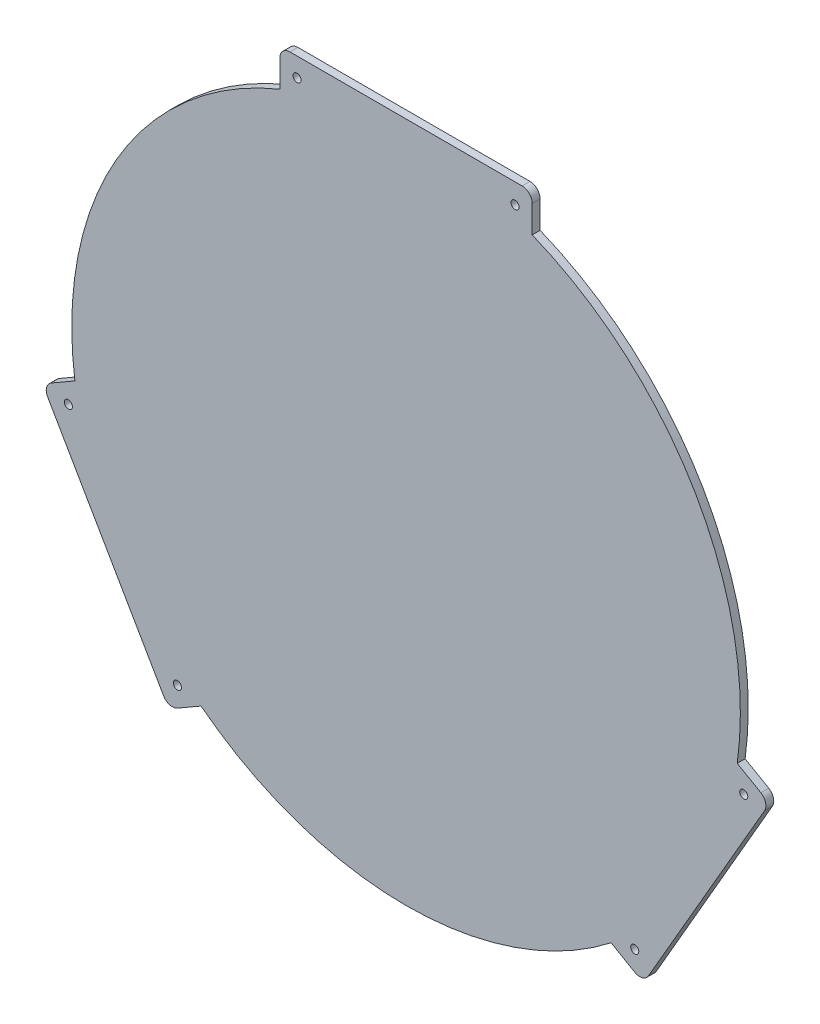
ISO-10303-21;
HEADER;
FILE_DESCRIPTION(('STEP AP214'),'2;1');
FILE_NAME('part.step','',(''),(''),'','','');
FILE_SCHEMA(('AUTOMOTIVE_DESIGN { 1 0 10303 214 1 1 1 1 }'));
ENDSEC;
DATA;
#1=APPLICATION_CONTEXT('core data for automotive mechanical design processes');
#2=APPLICATION_PROTOCOL_DEFINITION('international standard','automotive_design',2000,#1);
#3=PRODUCT_CONTEXT('',#1,'mechanical');
#4=PRODUCT('Part','Part','',(#3));
#5=PRODUCT_RELATED_PRODUCT_CATEGORY('part','',(#4));
#6=PRODUCT_DEFINITION_FORMATION('','',#4);
#7=PRODUCT_DEFINITION_CONTEXT('part definition',#1,'design');
#8=PRODUCT_DEFINITION('design','',#6,#7);
#9=PRODUCT_DEFINITION_SHAPE('','',#8);
#10=(LENGTH_UNIT() NAMED_UNIT(*) SI_UNIT(.MILLI.,.METRE.));
#11=(NAMED_UNIT(*) PLANE_ANGLE_UNIT() SI_UNIT($,.RADIAN.));
#12=(NAMED_UNIT(*) SI_UNIT($,.STERADIAN.) SOLID_ANGLE_UNIT());
#13=UNCERTAINTY_MEASURE_WITH_UNIT(LENGTH_MEASURE(1.E-05),#10,'distance_accuracy_value','');
#14=(GEOMETRIC_REPRESENTATION_CONTEXT(3) GLOBAL_UNCERTAINTY_ASSIGNED_CONTEXT((#13)) GLOBAL_UNIT_ASSIGNED_CONTEXT((#10,
#11,#12)) REPRESENTATION_CONTEXT('',''));
#15=CARTESIAN_POINT('',(0.,0.,0.));
#16=DIRECTION('',(0.,0.,1.));
#17=DIRECTION('',(1.,0.,0.));
#18=AXIS2_PLACEMENT_3D('',#15,#16,#17);
#19=CARTESIAN_POINT('',(102.500000000007,253.413429510902,3.125));
#20=DIRECTION('',(0.,0.,1.));
#21=DIRECTION('',(1.,0.,0.));
#22=AXIS2_PLACEMENT_3D('',#19,#20,#21);
#23=PLANE('',#22);
#24=CARTESIAN_POINT('',(14.6631076695361,92.5257269543871,3.125));
#25=DIRECTION('',(0.,0.,1.));
#26=DIRECTION('',(1.,0.,0.));
#27=AXIS2_PLACEMENT_3D('',#24,#25,#26);
#28=CIRCLE('',#27,1.60000000000005);
#29=CARTESIAN_POINT('',(16.2631076695362,92.5257269543871,3.125));
#30=VERTEX_POINT('',#29);
#31=EDGE_CURVE('E379',#30,#30,#28,.T.);
#32=ORIENTED_EDGE('',*,*,#31,.F.);
#33=EDGE_LOOP('',(#32));
#34=FACE_BOUND('',#33,.T.);
#35=CARTESIAN_POINT('',(282.336892330463,92.5257269543876,3.125));
#36=DIRECTION('',(0.,0.,1.));
#37=DIRECTION('',(1.,0.,0.));
#38=AXIS2_PLACEMENT_3D('',#35,#36,#37);
#39=CIRCLE('',#38,1.59999999999999);
#40=CARTESIAN_POINT('',(283.936892330463,92.5257269543876,3.125));
#41=VERTEX_POINT('',#40);
#42=EDGE_CURVE('E391',#41,#41,#39,.T.);
#43=ORIENTED_EDGE('',*,*,#42,.F.);
#44=EDGE_LOOP('',(#43));
#45=FACE_BOUND('',#44,.T.);
#46=CARTESIAN_POINT('',(105.299999999999,249.9134295109,3.125));
#47=DIRECTION('',(0.,0.,1.));
#48=DIRECTION('',(1.,0.,0.));
#49=AXIS2_PLACEMENT_3D('',#46,#47,#48);
#50=CIRCLE('',#49,1.59999999999999);
#51=CARTESIAN_POINT('',(106.899999999999,249.9134295109,3.125));
#52=VERTEX_POINT('',#51);
#53=EDGE_CURVE('E195',#52,#52,#50,.T.);
#54=ORIENTED_EDGE('',*,*,#53,.F.);
#55=EDGE_LOOP('',(#54));
#56=FACE_BOUND('',#55,.T.);
#57=CARTESIAN_POINT('',(102.500000000007,253.413429510902,3.125));
#58=DIRECTION('',(0.,0.,1.));
#59=DIRECTION('',(1.,0.,0.));
#60=AXIS2_PLACEMENT_3D('',#57,#58,#59);
#61=CIRCLE('',#60,4.);
#62=CARTESIAN_POINT('',(102.499999999973,257.413429510902,3.125));
#63=VERTEX_POINT('',#62);
#64=CARTESIAN_POINT('',(98.5000000000074,253.413429510902,3.125));
#65=VERTEX_POINT('',#64);
#66=EDGE_CURVE('E226',#63,#65,#61,.T.);
#67=ORIENTED_EDGE('',*,*,#66,.T.);
#68=DIRECTION('',(0.,-1.,0.));
#69=VECTOR('',#68,1.);
#70=CARTESIAN_POINT('',(98.5000000000074,253.413429510902,3.125));
#71=LINE('',#70,#69);
#72=CARTESIAN_POINT('',(98.5000000000069,242.617341428983,3.125));
#73=VERTEX_POINT('',#72);
#74=EDGE_CURVE('E124',#65,#73,#71,.T.);
#75=ORIENTED_EDGE('',*,*,#74,.T.);
#76=CARTESIAN_POINT('',(148.499999999999,119.913429510899,3.125));
#77=DIRECTION('',(0.,0.,1.));
#78=DIRECTION('',(1.,0.,0.));
#79=AXIS2_PLACEMENT_3D('',#76,#77,#78);
#80=CIRCLE('',#79,132.5);
#81=CARTESIAN_POINT('',(17.2352951352135,101.862743741081,3.125));
#82=VERTEX_POINT('',#81);
#83=EDGE_CURVE('E271',#73,#82,#80,.T.);
#84=ORIENTED_EDGE('',*,*,#83,.T.);
#85=DIRECTION('',(-0.866025403784438,-0.5,0.));
#86=VECTOR('',#85,1.);
#87=CARTESIAN_POINT('',(7.88560859477683,96.4646997001212,3.125));
#88=LINE('',#87,#86);
#89=CARTESIAN_POINT('',(7.88560859477683,96.4646997001212,3.125));
#90=VERTEX_POINT('',#89);
#91=EDGE_CURVE('E290',#82,#90,#88,.T.);
#92=ORIENTED_EDGE('',*,*,#91,.T.);
#93=CARTESIAN_POINT('',(9.88560859477682,93.0005980849835,3.125));
#94=DIRECTION('',(0.,0.,1.));
#95=DIRECTION('',(1.,0.,0.));
#96=AXIS2_PLACEMENT_3D('',#93,#94,#95);
#97=CIRCLE('',#96,4.);
#98=CARTESIAN_POINT('',(6.42150697963906,91.0005980849835,3.125));
#99=VERTEX_POINT('',#98);
#100=EDGE_CURVE('E287',#90,#99,#97,.T.);
#101=ORIENTED_EDGE('',*,*,#100,.T.);
#102=DIRECTION('',(0.5,-0.866025403784439,0.));
#103=VECTOR('',#102,1.);
#104=CARTESIAN_POINT('',(52.4215069796391,11.3262609368151,3.125));
#105=LINE('',#104,#103);
#106=CARTESIAN_POINT('',(52.4215069796391,11.3262609368151,3.125));
#107=VERTEX_POINT('',#106);
#108=EDGE_CURVE('E289',#99,#107,#105,.T.);
#109=ORIENTED_EDGE('',*,*,#108,.T.);
#110=CARTESIAN_POINT('',(55.8856085947768,13.3262609368152,3.125));
#111=DIRECTION('',(0.,0.,1.));
#112=DIRECTION('',(1.,0.,0.));
#113=AXIS2_PLACEMENT_3D('',#110,#111,#112);
#114=CIRCLE('',#113,4.00000000000001);
#115=CARTESIAN_POINT('',(57.8856085947768,9.86215932167743,3.125));
#116=VERTEX_POINT('',#115);
#117=EDGE_CURVE('E292',#107,#116,#114,.T.);
#118=ORIENTED_EDGE('',*,*,#117,.T.);
#119=DIRECTION('',(0.866025403784438,0.500000000000001,0.));
#120=VECTOR('',#119,1.);
#121=CARTESIAN_POINT('',(57.8856085947768,9.86215932167743,3.125));
#122=LINE('',#121,#120);
#123=CARTESIAN_POINT('',(67.2352951352134,15.2602033626372,3.125));
#124=VERTEX_POINT('',#123);
#125=EDGE_CURVE('E298',#116,#124,#122,.T.);
#126=ORIENTED_EDGE('',*,*,#125,.T.);
#127=CARTESIAN_POINT('',(148.499999999999,119.913429510899,3.125));
#128=DIRECTION('',(0.,0.,1.));
#129=DIRECTION('',(1.,0.,0.));
#130=AXIS2_PLACEMENT_3D('',#127,#128,#129);
#131=CIRCLE('',#130,132.5);
#132=CARTESIAN_POINT('',(229.764704864785,15.2602033626372,3.125));
#133=VERTEX_POINT('',#132);
#134=EDGE_CURVE('E300',#124,#133,#131,.T.);
#135=ORIENTED_EDGE('',*,*,#134,.T.);
#136=DIRECTION('',(0.866025403784436,-0.500000000000005,0.));
#137=VECTOR('',#136,1.);
#138=CARTESIAN_POINT('',(239.114391405222,9.86215932167748,3.125));
#139=LINE('',#138,#137);
#140=CARTESIAN_POINT('',(239.114391405222,9.8621593216775,3.125));
#141=VERTEX_POINT('',#140);
#142=EDGE_CURVE('E302',#133,#141,#139,.T.);
#143=ORIENTED_EDGE('',*,*,#142,.T.);
#144=CARTESIAN_POINT('',(241.114391405222,13.3262609368152,3.125));
#145=DIRECTION('',(0.,0.,1.));
#146=DIRECTION('',(1.,0.,0.));
#147=AXIS2_PLACEMENT_3D('',#144,#145,#146);
#148=CIRCLE('',#147,3.99999999999999);
#149=CARTESIAN_POINT('',(244.57849302036,11.3262609368155,3.125));
#150=VERTEX_POINT('',#149);
#151=EDGE_CURVE('E304',#141,#150,#148,.T.);
#152=ORIENTED_EDGE('',*,*,#151,.T.);
#153=DIRECTION('',(0.499999999999999,0.866025403784439,0.));
#154=VECTOR('',#153,1.);
#155=CARTESIAN_POINT('',(244.57849302036,11.3262609368155,3.125));
#156=LINE('',#155,#154);
#157=CARTESIAN_POINT('',(290.57849302036,91.0005980849839,3.125));
#158=VERTEX_POINT('',#157);
#159=EDGE_CURVE('E306',#150,#158,#156,.T.);
#160=ORIENTED_EDGE('',*,*,#159,.T.);
#161=CARTESIAN_POINT('',(287.114391405222,93.0005980849837,3.125));
#162=DIRECTION('',(0.,0.,1.));
#163=DIRECTION('',(1.,0.,0.));
#164=AXIS2_PLACEMENT_3D('',#161,#162,#163);
#165=CIRCLE('',#164,3.99999999999999);
#166=CARTESIAN_POINT('',(289.114391405222,96.4646997001215,3.125));
#167=VERTEX_POINT('',#166);
#168=EDGE_CURVE('E308',#158,#167,#165,.T.);
#169=ORIENTED_EDGE('',*,*,#168,.T.);
#170=DIRECTION('',(-0.866025403784436,0.500000000000005,0.));
#171=VECTOR('',#170,1.);
#172=CARTESIAN_POINT('',(289.114391405222,96.4646997001215,3.125));
#173=LINE('',#172,#171);
#174=CARTESIAN_POINT('',(279.764704864785,101.862743741081,3.125));
#175=VERTEX_POINT('',#174);
#176=EDGE_CURVE('E310',#167,#175,#173,.T.);
#177=ORIENTED_EDGE('',*,*,#176,.T.);
#178=CARTESIAN_POINT('',(148.499999999999,119.913429510899,3.125));
#179=DIRECTION('',(0.,0.,1.));
#180=DIRECTION('',(1.,0.,0.));
#181=AXIS2_PLACEMENT_3D('',#178,#179,#180);
#182=CIRCLE('',#181,132.5);
#183=CARTESIAN_POINT('',(198.500000000007,242.617341428977,3.125));
#184=VERTEX_POINT('',#183);
#185=EDGE_CURVE('E173',#175,#184,#182,.T.);
#186=ORIENTED_EDGE('',*,*,#185,.T.);
#187=DIRECTION('',(0.,1.,0.));
#188=VECTOR('',#187,1.);
#189=CARTESIAN_POINT('',(198.500000000007,253.413429510896,3.125));
#190=LINE('',#189,#188);
#191=CARTESIAN_POINT('',(198.500000000007,253.413429510896,3.125));
#192=VERTEX_POINT('',#191);
#193=EDGE_CURVE('E167',#184,#192,#190,.T.);
#194=ORIENTED_EDGE('',*,*,#193,.T.);
#195=CARTESIAN_POINT('',(194.500000000007,253.413429510897,3.125));
#196=DIRECTION('',(0.,0.,1.));
#197=DIRECTION('',(1.,0.,0.));
#198=AXIS2_PLACEMENT_3D('',#195,#196,#197);
#199=CIRCLE('',#198,4.);
#200=CARTESIAN_POINT('',(194.499999999973,257.413429510897,3.125));
#201=VERTEX_POINT('',#200);
#202=EDGE_CURVE('E171',#192,#201,#199,.T.);
#203=ORIENTED_EDGE('',*,*,#202,.T.);
#204=DIRECTION('',(-1.,0.,0.));
#205=VECTOR('',#204,1.);
#206=CARTESIAN_POINT('',(194.499999999973,257.413429510897,3.125));
#207=LINE('',#206,#205);
#208=EDGE_CURVE('E51',#201,#63,#207,.T.);
#209=ORIENTED_EDGE('',*,*,#208,.T.);
#210=EDGE_LOOP('',(#67,#75,#84,#92,#101,#109,#118,#126,#135,#143,#152,#160,#169,#177,#186,#194,
#203,#209));
#211=FACE_BOUND('',#210,.T.);
#212=CARTESIAN_POINT('',(191.699999999999,249.513429510899,3.125));
#213=DIRECTION('',(0.,0.,1.));
#214=DIRECTION('',(1.,0.,0.));
#215=AXIS2_PLACEMENT_3D('',#212,#213,#214);
#216=CIRCLE('',#215,1.59999999999999);
#217=CARTESIAN_POINT('',(193.299999999999,249.513429510899,3.125));
#218=VERTEX_POINT('',#217);
#219=EDGE_CURVE('E397',#218,#218,#216,.T.);
#220=ORIENTED_EDGE('',*,*,#219,.F.);
#221=EDGE_LOOP('',(#220));
#222=FACE_BOUND('',#221,.T.);
#223=CARTESIAN_POINT('',(239.136892330463,17.701132067412,3.125));
#224=DIRECTION('',(0.,0.,1.));
#225=DIRECTION('',(1.,0.,0.));
#226=AXIS2_PLACEMENT_3D('',#223,#224,#225);
#227=CIRCLE('',#226,1.60000000000002);
#228=CARTESIAN_POINT('',(240.736892330463,17.701132067412,3.125));
#229=VERTEX_POINT('',#228);
#230=EDGE_CURVE('E385',#229,#229,#227,.T.);
#231=ORIENTED_EDGE('',*,*,#230,.F.);
#232=EDGE_LOOP('',(#231));
#233=FACE_BOUND('',#232,.T.);
#234=CARTESIAN_POINT('',(57.8631076695365,17.7011320674113,3.125));
#235=DIRECTION('',(0.,0.,1.));
#236=DIRECTION('',(1.,0.,0.));
#237=AXIS2_PLACEMENT_3D('',#234,#235,#236);
#238=CIRCLE('',#237,1.6);
#239=CARTESIAN_POINT('',(59.4631076695365,17.7011320674113,3.125));
#240=VERTEX_POINT('',#239);
#241=EDGE_CURVE('E370',#240,#240,#238,.T.);
#242=ORIENTED_EDGE('',*,*,#241,.F.);
#243=EDGE_LOOP('',(#242));
#244=FACE_BOUND('',#243,.T.);
#245=ADVANCED_FACE('F34',(#34,#45,#56,#211,#222,#233,#244),#23,.T.);
#246=CARTESIAN_POINT('',(102.500000000007,253.413429510902,0.));
#247=DIRECTION('',(0.,0.,1.));
#248=DIRECTION('',(1.,0.,0.));
#249=AXIS2_PLACEMENT_3D('',#246,#247,#248);
#250=PLANE('',#249);
#251=CARTESIAN_POINT('',(14.6631076695361,92.5257269543871,0.));
#252=DIRECTION('',(0.,0.,1.));
#253=DIRECTION('',(1.,0.,0.));
#254=AXIS2_PLACEMENT_3D('',#251,#252,#253);
#255=CIRCLE('',#254,1.60000000000005);
#256=CARTESIAN_POINT('',(16.2631076695362,92.5257269543871,0.));
#257=VERTEX_POINT('',#256);
#258=EDGE_CURVE('E376',#257,#257,#255,.T.);
#259=ORIENTED_EDGE('',*,*,#258,.T.);
#260=EDGE_LOOP('',(#259));
#261=FACE_BOUND('',#260,.T.);
#262=CARTESIAN_POINT('',(282.336892330463,92.5257269543876,0.));
#263=DIRECTION('',(0.,0.,1.));
#264=DIRECTION('',(1.,0.,0.));
#265=AXIS2_PLACEMENT_3D('',#262,#263,#264);
#266=CIRCLE('',#265,1.59999999999999);
#267=CARTESIAN_POINT('',(283.936892330463,92.5257269543876,0.));
#268=VERTEX_POINT('',#267);
#269=EDGE_CURVE('E388',#268,#268,#266,.T.);
#270=ORIENTED_EDGE('',*,*,#269,.T.);
#271=EDGE_LOOP('',(#270));
#272=FACE_BOUND('',#271,.T.);
#273=CARTESIAN_POINT('',(105.299999999999,249.9134295109,0.));
#274=DIRECTION('',(0.,0.,1.));
#275=DIRECTION('',(1.,0.,0.));
#276=AXIS2_PLACEMENT_3D('',#273,#274,#275);
#277=CIRCLE('',#276,1.59999999999999);
#278=CARTESIAN_POINT('',(106.899999999999,249.9134295109,0.));
#279=VERTEX_POINT('',#278);
#280=EDGE_CURVE('E400',#279,#279,#277,.T.);
#281=ORIENTED_EDGE('',*,*,#280,.T.);
#282=EDGE_LOOP('',(#281));
#283=FACE_BOUND('',#282,.T.);
#284=CARTESIAN_POINT('',(102.500000000007,253.413429510902,0.));
#285=DIRECTION('',(0.,0.,1.));
#286=DIRECTION('',(1.,0.,0.));
#287=AXIS2_PLACEMENT_3D('',#284,#285,#286);
#288=CIRCLE('',#287,4.);
#289=CARTESIAN_POINT('',(102.499999999973,257.413429510902,0.));
#290=VERTEX_POINT('',#289);
#291=CARTESIAN_POINT('',(98.5000000000074,253.413429510902,0.));
#292=VERTEX_POINT('',#291);
#293=EDGE_CURVE('E191',#290,#292,#288,.T.);
#294=ORIENTED_EDGE('',*,*,#293,.F.);
#295=DIRECTION('',(-1.,0.,0.));
#296=VECTOR('',#295,1.);
#297=CARTESIAN_POINT('',(194.499999999973,257.413429510897,0.));
#298=LINE('',#297,#296);
#299=CARTESIAN_POINT('',(194.499999999973,257.413429510897,0.));
#300=VERTEX_POINT('',#299);
#301=EDGE_CURVE('E116',#300,#290,#298,.T.);
#302=ORIENTED_EDGE('',*,*,#301,.F.);
#303=CARTESIAN_POINT('',(194.500000000007,253.413429510897,0.));
#304=DIRECTION('',(0.,0.,1.));
#305=DIRECTION('',(1.,0.,0.));
#306=AXIS2_PLACEMENT_3D('',#303,#304,#305);
#307=CIRCLE('',#306,4.);
#308=CARTESIAN_POINT('',(198.500000000007,253.413429510896,0.));
#309=VERTEX_POINT('',#308);
#310=EDGE_CURVE('E110',#309,#300,#307,.T.);
#311=ORIENTED_EDGE('',*,*,#310,.F.);
#312=DIRECTION('',(0.,1.,0.));
#313=VECTOR('',#312,1.);
#314=CARTESIAN_POINT('',(198.500000000007,253.413429510896,0.));
#315=LINE('',#314,#313);
#316=CARTESIAN_POINT('',(198.500000000007,242.617341428977,0.));
#317=VERTEX_POINT('',#316);
#318=EDGE_CURVE('E181',#317,#309,#315,.T.);
#319=ORIENTED_EDGE('',*,*,#318,.F.);
#320=CARTESIAN_POINT('',(148.499999999999,119.913429510899,0.));
#321=DIRECTION('',(0.,0.,1.));
#322=DIRECTION('',(1.,0.,0.));
#323=AXIS2_PLACEMENT_3D('',#320,#321,#322);
#324=CIRCLE('',#323,132.5);
#325=CARTESIAN_POINT('',(279.764704864785,101.862743741081,0.));
#326=VERTEX_POINT('',#325);
#327=EDGE_CURVE('E221',#326,#317,#324,.T.);
#328=ORIENTED_EDGE('',*,*,#327,.F.);
#329=DIRECTION('',(-0.866025403784436,0.500000000000005,0.));
#330=VECTOR('',#329,1.);
#331=CARTESIAN_POINT('',(289.114391405222,96.4646997001215,0.));
#332=LINE('',#331,#330);
#333=CARTESIAN_POINT('',(289.114391405222,96.4646997001215,0.));
#334=VERTEX_POINT('',#333);
#335=EDGE_CURVE('E219',#334,#326,#332,.T.);
#336=ORIENTED_EDGE('',*,*,#335,.F.);
#337=CARTESIAN_POINT('',(287.114391405222,93.0005980849837,0.));
#338=DIRECTION('',(0.,0.,1.));
#339=DIRECTION('',(1.,0.,0.));
#340=AXIS2_PLACEMENT_3D('',#337,#338,#339);
#341=CIRCLE('',#340,3.99999999999999);
#342=CARTESIAN_POINT('',(290.57849302036,91.0005980849839,0.));
#343=VERTEX_POINT('',#342);
#344=EDGE_CURVE('E217',#343,#334,#341,.T.);
#345=ORIENTED_EDGE('',*,*,#344,.F.);
#346=DIRECTION('',(0.499999999999999,0.866025403784439,0.));
#347=VECTOR('',#346,1.);
#348=CARTESIAN_POINT('',(244.57849302036,11.3262609368155,0.));
#349=LINE('',#348,#347);
#350=CARTESIAN_POINT('',(244.57849302036,11.3262609368155,0.));
#351=VERTEX_POINT('',#350);
#352=EDGE_CURVE('E215',#351,#343,#349,.T.);
#353=ORIENTED_EDGE('',*,*,#352,.F.);
#354=CARTESIAN_POINT('',(241.114391405222,13.3262609368152,0.));
#355=DIRECTION('',(0.,0.,1.));
#356=DIRECTION('',(1.,0.,0.));
#357=AXIS2_PLACEMENT_3D('',#354,#355,#356);
#358=CIRCLE('',#357,3.99999999999999);
#359=CARTESIAN_POINT('',(239.114391405222,9.8621593216775,0.));
#360=VERTEX_POINT('',#359);
#361=EDGE_CURVE('E213',#360,#351,#358,.T.);
#362=ORIENTED_EDGE('',*,*,#361,.F.);
#363=DIRECTION('',(0.866025403784436,-0.500000000000005,0.));
#364=VECTOR('',#363,1.);
#365=CARTESIAN_POINT('',(239.114391405222,9.86215932167748,0.));
#366=LINE('',#365,#364);
#367=CARTESIAN_POINT('',(229.764704864785,15.2602033626372,0.));
#368=VERTEX_POINT('',#367);
#369=EDGE_CURVE('E211',#368,#360,#366,.T.);
#370=ORIENTED_EDGE('',*,*,#369,.F.);
#371=CARTESIAN_POINT('',(148.499999999999,119.913429510899,0.));
#372=DIRECTION('',(0.,0.,1.));
#373=DIRECTION('',(1.,0.,0.));
#374=AXIS2_PLACEMENT_3D('',#371,#372,#373);
#375=CIRCLE('',#374,132.5);
#376=CARTESIAN_POINT('',(67.2352951352134,15.2602033626372,0.));
#377=VERTEX_POINT('',#376);
#378=EDGE_CURVE('E209',#377,#368,#375,.T.);
#379=ORIENTED_EDGE('',*,*,#378,.F.);
#380=DIRECTION('',(0.866025403784438,0.500000000000001,0.));
#381=VECTOR('',#380,1.);
#382=CARTESIAN_POINT('',(57.8856085947768,9.86215932167743,0.));
#383=LINE('',#382,#381);
#384=CARTESIAN_POINT('',(57.8856085947768,9.86215932167743,0.));
#385=VERTEX_POINT('',#384);
#386=EDGE_CURVE('E207',#385,#377,#383,.T.);
#387=ORIENTED_EDGE('',*,*,#386,.F.);
#388=CARTESIAN_POINT('',(55.8856085947768,13.3262609368152,0.));
#389=DIRECTION('',(0.,0.,1.));
#390=DIRECTION('',(1.,0.,0.));
#391=AXIS2_PLACEMENT_3D('',#388,#389,#390);
#392=CIRCLE('',#391,4.00000000000001);
#393=CARTESIAN_POINT('',(52.4215069796391,11.3262609368151,0.));
#394=VERTEX_POINT('',#393);
#395=EDGE_CURVE('E205',#394,#385,#392,.T.);
#396=ORIENTED_EDGE('',*,*,#395,.F.);
#397=DIRECTION('',(0.5,-0.866025403784439,0.));
#398=VECTOR('',#397,1.);
#399=CARTESIAN_POINT('',(52.4215069796391,11.3262609368151,0.));
#400=LINE('',#399,#398);
#401=CARTESIAN_POINT('',(6.42150697963906,91.0005980849835,0.));
#402=VERTEX_POINT('',#401);
#403=EDGE_CURVE('E203',#402,#394,#400,.T.);
#404=ORIENTED_EDGE('',*,*,#403,.F.);
#405=CARTESIAN_POINT('',(9.88560859477682,93.0005980849835,0.));
#406=DIRECTION('',(0.,0.,1.));
#407=DIRECTION('',(1.,0.,0.));
#408=AXIS2_PLACEMENT_3D('',#405,#406,#407);
#409=CIRCLE('',#408,4.);
#410=CARTESIAN_POINT('',(7.88560859477683,96.4646997001212,0.));
#411=VERTEX_POINT('',#410);
#412=EDGE_CURVE('E201',#411,#402,#409,.T.);
#413=ORIENTED_EDGE('',*,*,#412,.F.);
#414=DIRECTION('',(-0.866025403784438,-0.5,0.));
#415=VECTOR('',#414,1.);
#416=CARTESIAN_POINT('',(7.88560859477683,96.4646997001212,0.));
#417=LINE('',#416,#415);
#418=CARTESIAN_POINT('',(17.2352951352135,101.862743741081,0.));
#419=VERTEX_POINT('',#418);
#420=EDGE_CURVE('E199',#419,#411,#417,.T.);
#421=ORIENTED_EDGE('',*,*,#420,.F.);
#422=CARTESIAN_POINT('',(148.499999999999,119.913429510899,0.));
#423=DIRECTION('',(0.,0.,1.));
#424=DIRECTION('',(1.,0.,0.));
#425=AXIS2_PLACEMENT_3D('',#422,#423,#424);
#426=CIRCLE('',#425,132.5);
#427=CARTESIAN_POINT('',(98.5000000000069,242.617341428983,0.));
#428=VERTEX_POINT('',#427);
#429=EDGE_CURVE('E197',#428,#419,#426,.T.);
#430=ORIENTED_EDGE('',*,*,#429,.F.);
#431=DIRECTION('',(0.,-1.,0.));
#432=VECTOR('',#431,1.);
#433=CARTESIAN_POINT('',(98.5000000000074,253.413429510902,0.));
#434=LINE('',#433,#432);
#435=EDGE_CURVE('E194',#292,#428,#434,.T.);
#436=ORIENTED_EDGE('',*,*,#435,.F.);
#437=EDGE_LOOP('',(#294,#302,#311,#319,#328,#336,#345,#353,#362,#370,#379,#387,#396,#404,#413,
#421,#430,#436));
#438=FACE_BOUND('',#437,.T.);
#439=CARTESIAN_POINT('',(191.699999999999,249.513429510899,0.));
#440=DIRECTION('',(0.,0.,1.));
#441=DIRECTION('',(1.,0.,0.));
#442=AXIS2_PLACEMENT_3D('',#439,#440,#441);
#443=CIRCLE('',#442,1.59999999999999);
#444=CARTESIAN_POINT('',(193.299999999999,249.513429510899,0.));
#445=VERTEX_POINT('',#444);
#446=EDGE_CURVE('E394',#445,#445,#443,.T.);
#447=ORIENTED_EDGE('',*,*,#446,.T.);
#448=EDGE_LOOP('',(#447));
#449=FACE_BOUND('',#448,.T.);
#450=CARTESIAN_POINT('',(239.136892330463,17.701132067412,0.));
#451=DIRECTION('',(0.,0.,1.));
#452=DIRECTION('',(1.,0.,0.));
#453=AXIS2_PLACEMENT_3D('',#450,#451,#452);
#454=CIRCLE('',#453,1.60000000000002);
#455=CARTESIAN_POINT('',(240.736892330463,17.701132067412,0.));
#456=VERTEX_POINT('',#455);
#457=EDGE_CURVE('E382',#456,#456,#454,.T.);
#458=ORIENTED_EDGE('',*,*,#457,.T.);
#459=EDGE_LOOP('',(#458));
#460=FACE_BOUND('',#459,.T.);
#461=CARTESIAN_POINT('',(57.8631076695365,17.7011320674113,0.));
#462=DIRECTION('',(0.,0.,1.));
#463=DIRECTION('',(1.,0.,0.));
#464=AXIS2_PLACEMENT_3D('',#461,#462,#463);
#465=CIRCLE('',#464,1.6);
#466=CARTESIAN_POINT('',(59.4631076695365,17.7011320674113,0.));
#467=VERTEX_POINT('',#466);
#468=EDGE_CURVE('E373',#467,#467,#465,.T.);
#469=ORIENTED_EDGE('',*,*,#468,.T.);
#470=EDGE_LOOP('',(#469));
#471=FACE_BOUND('',#470,.T.);
#472=ADVANCED_FACE('F275',(#261,#272,#283,#438,#449,#460,#471),#250,.F.);
#473=CARTESIAN_POINT('',(102.500000000007,253.413429510902,3.125));
#474=DIRECTION('',(0.,0.,-1.));
#475=DIRECTION('',(-1.,0.,0.));
#476=AXIS2_PLACEMENT_3D('',#473,#474,#475);
#477=CYLINDRICAL_SURFACE('',#476,4.);
#478=ORIENTED_EDGE('',*,*,#293,.T.);
#479=DIRECTION('',(0.,0.,-1.));
#480=VECTOR('',#479,1.);
#481=CARTESIAN_POINT('',(98.5000000000074,253.413429510902,3.125));
#482=LINE('',#481,#480);
#483=EDGE_CURVE('E11',#65,#292,#482,.T.);
#484=ORIENTED_EDGE('',*,*,#483,.F.);
#485=ORIENTED_EDGE('',*,*,#66,.F.);
#486=DIRECTION('',(0.,0.,-1.));
#487=VECTOR('',#486,1.);
#488=CARTESIAN_POINT('',(102.499999999973,257.413429510902,3.125));
#489=LINE('',#488,#487);
#490=EDGE_CURVE('E187',#63,#290,#489,.T.);
#491=ORIENTED_EDGE('',*,*,#490,.T.);
#492=EDGE_LOOP('',(#478,#484,#485,#491));
#493=FACE_BOUND('',#492,.T.);
#494=ADVANCED_FACE('F36',(#493),#477,.T.);
#495=CARTESIAN_POINT('',(98.5000000000074,253.413429510902,3.125));
#496=DIRECTION('',(1.,0.,0.));
#497=DIRECTION('',(0.,1.,0.));
#498=AXIS2_PLACEMENT_3D('',#495,#496,#497);
#499=PLANE('',#498);
#500=ORIENTED_EDGE('',*,*,#435,.T.);
#501=DIRECTION('',(0.,0.,-1.));
#502=VECTOR('',#501,1.);
#503=CARTESIAN_POINT('',(98.5000000000069,242.617341428983,3.125));
#504=LINE('',#503,#502);
#505=EDGE_CURVE('E43',#73,#428,#504,.T.);
#506=ORIENTED_EDGE('',*,*,#505,.F.);
#507=ORIENTED_EDGE('',*,*,#74,.F.);
#508=ORIENTED_EDGE('',*,*,#483,.T.);
#509=EDGE_LOOP('',(#500,#506,#507,#508));
#510=FACE_BOUND('',#509,.T.);
#511=ADVANCED_FACE('F587',(#510),#499,.F.);
#512=CARTESIAN_POINT('',(148.499999999999,119.913429510899,3.125));
#513=DIRECTION('',(0.,0.,-1.));
#514=DIRECTION('',(-1.,0.,0.));
#515=AXIS2_PLACEMENT_3D('',#512,#513,#514);
#516=CYLINDRICAL_SURFACE('',#515,132.5);
#517=ORIENTED_EDGE('',*,*,#429,.T.);
#518=DIRECTION('',(0.,0.,-1.));
#519=VECTOR('',#518,1.);
#520=CARTESIAN_POINT('',(17.2352951352135,101.862743741081,3.125));
#521=LINE('',#520,#519);
#522=EDGE_CURVE('E263',#82,#419,#521,.T.);
#523=ORIENTED_EDGE('',*,*,#522,.F.);
#524=ORIENTED_EDGE('',*,*,#83,.F.);
#525=ORIENTED_EDGE('',*,*,#505,.T.);
#526=EDGE_LOOP('',(#517,#523,#524,#525));
#527=FACE_BOUND('',#526,.T.);
#528=ADVANCED_FACE('F269',(#527),#516,.T.);
#529=CARTESIAN_POINT('',(7.88560859477683,96.4646997001212,3.125));
#530=DIRECTION('',(0.5,-0.866025403784438,0.));
#531=DIRECTION('',(0.866025403784439,0.5,0.));
#532=AXIS2_PLACEMENT_3D('',#529,#530,#531);
#533=PLANE('',#532);
#534=ORIENTED_EDGE('',*,*,#420,.T.);
#535=DIRECTION('',(0.,0.,-1.));
#536=VECTOR('',#535,1.);
#537=CARTESIAN_POINT('',(7.88560859477683,96.4646997001212,3.125));
#538=LINE('',#537,#536);
#539=EDGE_CURVE('E260',#90,#411,#538,.T.);
#540=ORIENTED_EDGE('',*,*,#539,.F.);
#541=ORIENTED_EDGE('',*,*,#91,.F.);
#542=ORIENTED_EDGE('',*,*,#522,.T.);
#543=EDGE_LOOP('',(#534,#540,#541,#542));
#544=FACE_BOUND('',#543,.T.);
#545=ADVANCED_FACE('F281',(#544),#533,.F.);
#546=CARTESIAN_POINT('',(9.88560859477682,93.0005980849835,3.125));
#547=DIRECTION('',(0.,0.,-1.));
#548=DIRECTION('',(-1.,0.,0.));
#549=AXIS2_PLACEMENT_3D('',#546,#547,#548);
#550=CYLINDRICAL_SURFACE('',#549,4.);
#551=ORIENTED_EDGE('',*,*,#412,.T.);
#552=DIRECTION('',(0.,0.,-1.));
#553=VECTOR('',#552,1.);
#554=CARTESIAN_POINT('',(6.42150697963906,91.0005980849835,3.125));
#555=LINE('',#554,#553);
#556=EDGE_CURVE('E257',#99,#402,#555,.T.);
#557=ORIENTED_EDGE('',*,*,#556,.F.);
#558=ORIENTED_EDGE('',*,*,#100,.F.);
#559=ORIENTED_EDGE('',*,*,#539,.T.);
#560=EDGE_LOOP('',(#551,#557,#558,#559));
#561=FACE_BOUND('',#560,.T.);
#562=ADVANCED_FACE('F285',(#561),#550,.T.);
#563=CARTESIAN_POINT('',(52.4215069796391,11.3262609368151,3.125));
#564=DIRECTION('',(0.866025403784439,0.5,0.));
#565=DIRECTION('',(-0.5,0.866025403784439,0.));
#566=AXIS2_PLACEMENT_3D('',#563,#564,#565);
#567=PLANE('',#566);
#568=ORIENTED_EDGE('',*,*,#403,.T.);
#569=DIRECTION('',(0.,0.,-1.));
#570=VECTOR('',#569,1.);
#571=CARTESIAN_POINT('',(52.4215069796391,11.3262609368151,3.125));
#572=LINE('',#571,#570);
#573=EDGE_CURVE('E254',#107,#394,#572,.T.);
#574=ORIENTED_EDGE('',*,*,#573,.F.);
#575=ORIENTED_EDGE('',*,*,#108,.F.);
#576=ORIENTED_EDGE('',*,*,#556,.T.);
#577=EDGE_LOOP('',(#568,#574,#575,#576));
#578=FACE_BOUND('',#577,.T.);
#579=ADVANCED_FACE('F552',(#578),#567,.F.);
#580=CARTESIAN_POINT('',(55.8856085947768,13.3262609368152,3.125));
#581=DIRECTION('',(0.,0.,-1.));
#582=DIRECTION('',(-1.,0.,0.));
#583=AXIS2_PLACEMENT_3D('',#580,#581,#582);
#584=CYLINDRICAL_SURFACE('',#583,4.00000000000001);
#585=ORIENTED_EDGE('',*,*,#395,.T.);
#586=DIRECTION('',(0.,0.,-1.));
#587=VECTOR('',#586,1.);
#588=CARTESIAN_POINT('',(57.8856085947768,9.86215932167743,3.125));
#589=LINE('',#588,#587);
#590=EDGE_CURVE('E251',#116,#385,#589,.T.);
#591=ORIENTED_EDGE('',*,*,#590,.F.);
#592=ORIENTED_EDGE('',*,*,#117,.F.);
#593=ORIENTED_EDGE('',*,*,#573,.T.);
#594=EDGE_LOOP('',(#585,#591,#592,#593));
#595=FACE_BOUND('',#594,.T.);
#596=ADVANCED_FACE('F542',(#595),#584,.T.);
#597=CARTESIAN_POINT('',(57.8856085947768,9.86215932167743,3.125));
#598=DIRECTION('',(-0.500000000000001,0.866025403784438,0.));
#599=DIRECTION('',(-0.866025403784438,-0.500000000000001,0.));
#600=AXIS2_PLACEMENT_3D('',#597,#598,#599);
#601=PLANE('',#600);
#602=ORIENTED_EDGE('',*,*,#386,.T.);
#603=DIRECTION('',(0.,0.,-1.));
#604=VECTOR('',#603,1.);
#605=CARTESIAN_POINT('',(67.2352951352134,15.2602033626372,3.125));
#606=LINE('',#605,#604);
#607=EDGE_CURVE('E248',#124,#377,#606,.T.);
#608=ORIENTED_EDGE('',*,*,#607,.F.);
#609=ORIENTED_EDGE('',*,*,#125,.F.);
#610=ORIENTED_EDGE('',*,*,#590,.T.);
#611=EDGE_LOOP('',(#602,#608,#609,#610));
#612=FACE_BOUND('',#611,.T.);
#613=ADVANCED_FACE('F532',(#612),#601,.F.);
#614=CARTESIAN_POINT('',(148.499999999999,119.913429510899,3.125));
#615=DIRECTION('',(0.,0.,-1.));
#616=DIRECTION('',(-1.,0.,0.));
#617=AXIS2_PLACEMENT_3D('',#614,#615,#616);
#618=CYLINDRICAL_SURFACE('',#617,132.5);
#619=ORIENTED_EDGE('',*,*,#378,.T.);
#620=DIRECTION('',(0.,0.,-1.));
#621=VECTOR('',#620,1.);
#622=CARTESIAN_POINT('',(229.764704864785,15.2602033626372,3.125));
#623=LINE('',#622,#621);
#624=EDGE_CURVE('E245',#133,#368,#623,.T.);
#625=ORIENTED_EDGE('',*,*,#624,.F.);
#626=ORIENTED_EDGE('',*,*,#134,.F.);
#627=ORIENTED_EDGE('',*,*,#607,.T.);
#628=EDGE_LOOP('',(#619,#625,#626,#627));
#629=FACE_BOUND('',#628,.T.);
#630=ADVANCED_FACE('F522',(#629),#618,.T.);
#631=CARTESIAN_POINT('',(239.114391405222,9.86215932167748,3.125));
#632=DIRECTION('',(0.500000000000005,0.866025403784436,0.));
#633=DIRECTION('',(-0.866025403784436,0.500000000000005,0.));
#634=AXIS2_PLACEMENT_3D('',#631,#632,#633);
#635=PLANE('',#634);
#636=ORIENTED_EDGE('',*,*,#369,.T.);
#637=DIRECTION('',(0.,0.,-1.));
#638=VECTOR('',#637,1.);
#639=CARTESIAN_POINT('',(239.114391405222,9.8621593216775,3.125));
#640=LINE('',#639,#638);
#641=EDGE_CURVE('E242',#141,#360,#640,.T.);
#642=ORIENTED_EDGE('',*,*,#641,.F.);
#643=ORIENTED_EDGE('',*,*,#142,.F.);
#644=ORIENTED_EDGE('',*,*,#624,.T.);
#645=EDGE_LOOP('',(#636,#642,#643,#644));
#646=FACE_BOUND('',#645,.T.);
#647=ADVANCED_FACE('F512',(#646),#635,.F.);
#648=CARTESIAN_POINT('',(241.114391405222,13.3262609368152,3.125));
#649=DIRECTION('',(0.,0.,-1.));
#650=DIRECTION('',(-1.,0.,0.));
#651=AXIS2_PLACEMENT_3D('',#648,#649,#650);
#652=CYLINDRICAL_SURFACE('',#651,3.99999999999999);
#653=ORIENTED_EDGE('',*,*,#361,.T.);
#654=DIRECTION('',(0.,0.,-1.));
#655=VECTOR('',#654,1.);
#656=CARTESIAN_POINT('',(244.57849302036,11.3262609368155,3.125));
#657=LINE('',#656,#655);
#658=EDGE_CURVE('E239',#150,#351,#657,.T.);
#659=ORIENTED_EDGE('',*,*,#658,.F.);
#660=ORIENTED_EDGE('',*,*,#151,.F.);
#661=ORIENTED_EDGE('',*,*,#641,.T.);
#662=EDGE_LOOP('',(#653,#659,#660,#661));
#663=FACE_BOUND('',#662,.T.);
#664=ADVANCED_FACE('F502',(#663),#652,.T.);
#665=CARTESIAN_POINT('',(244.57849302036,11.3262609368155,3.125));
#666=DIRECTION('',(-0.866025403784439,0.499999999999999,0.));
#667=DIRECTION('',(-0.499999999999999,-0.866025403784439,0.));
#668=AXIS2_PLACEMENT_3D('',#665,#666,#667);
#669=PLANE('',#668);
#670=ORIENTED_EDGE('',*,*,#352,.T.);
#671=DIRECTION('',(0.,0.,-1.));
#672=VECTOR('',#671,1.);
#673=CARTESIAN_POINT('',(290.57849302036,91.0005980849839,3.125));
#674=LINE('',#673,#672);
#675=EDGE_CURVE('E236',#158,#343,#674,.T.);
#676=ORIENTED_EDGE('',*,*,#675,.F.);
#677=ORIENTED_EDGE('',*,*,#159,.F.);
#678=ORIENTED_EDGE('',*,*,#658,.T.);
#679=EDGE_LOOP('',(#670,#676,#677,#678));
#680=FACE_BOUND('',#679,.T.);
#681=ADVANCED_FACE('F492',(#680),#669,.F.);
#682=CARTESIAN_POINT('',(287.114391405222,93.0005980849837,3.125));
#683=DIRECTION('',(0.,0.,-1.));
#684=DIRECTION('',(-1.,0.,0.));
#685=AXIS2_PLACEMENT_3D('',#682,#683,#684);
#686=CYLINDRICAL_SURFACE('',#685,3.99999999999999);
#687=ORIENTED_EDGE('',*,*,#344,.T.);
#688=DIRECTION('',(0.,0.,-1.));
#689=VECTOR('',#688,1.);
#690=CARTESIAN_POINT('',(289.114391405222,96.4646997001215,3.125));
#691=LINE('',#690,#689);
#692=EDGE_CURVE('E233',#167,#334,#691,.T.);
#693=ORIENTED_EDGE('',*,*,#692,.F.);
#694=ORIENTED_EDGE('',*,*,#168,.F.);
#695=ORIENTED_EDGE('',*,*,#675,.T.);
#696=EDGE_LOOP('',(#687,#693,#694,#695));
#697=FACE_BOUND('',#696,.T.);
#698=ADVANCED_FACE('F483',(#697),#686,.T.);
#699=CARTESIAN_POINT('',(289.114391405222,96.4646997001215,3.125));
#700=DIRECTION('',(-0.500000000000005,-0.866025403784436,0.));
#701=DIRECTION('',(0.866025403784436,-0.500000000000005,0.));
#702=AXIS2_PLACEMENT_3D('',#699,#700,#701);
#703=PLANE('',#702);
#704=ORIENTED_EDGE('',*,*,#335,.T.);
#705=DIRECTION('',(0.,0.,-1.));
#706=VECTOR('',#705,1.);
#707=CARTESIAN_POINT('',(279.764704864785,101.862743741081,3.125));
#708=LINE('',#707,#706);
#709=EDGE_CURVE('E230',#175,#326,#708,.T.);
#710=ORIENTED_EDGE('',*,*,#709,.F.);
#711=ORIENTED_EDGE('',*,*,#176,.F.);
#712=ORIENTED_EDGE('',*,*,#692,.T.);
#713=EDGE_LOOP('',(#704,#710,#711,#712));
#714=FACE_BOUND('',#713,.T.);
#715=ADVANCED_FACE('F316',(#714),#703,.F.);
#716=CARTESIAN_POINT('',(148.499999999999,119.913429510899,3.125));
#717=DIRECTION('',(0.,0.,-1.));
#718=DIRECTION('',(-1.,0.,0.));
#719=AXIS2_PLACEMENT_3D('',#716,#717,#718);
#720=CYLINDRICAL_SURFACE('',#719,132.5);
#721=ORIENTED_EDGE('',*,*,#327,.T.);
#722=DIRECTION('',(0.,0.,-1.));
#723=VECTOR('',#722,1.);
#724=CARTESIAN_POINT('',(198.500000000007,242.617341428977,3.125));
#725=LINE('',#724,#723);
#726=EDGE_CURVE('E182',#184,#317,#725,.T.);
#727=ORIENTED_EDGE('',*,*,#726,.F.);
#728=ORIENTED_EDGE('',*,*,#185,.F.);
#729=ORIENTED_EDGE('',*,*,#709,.T.);
#730=EDGE_LOOP('',(#721,#727,#728,#729));
#731=FACE_BOUND('',#730,.T.);
#732=ADVANCED_FACE('F320',(#731),#720,.T.);
#733=CARTESIAN_POINT('',(198.500000000007,253.413429510896,3.125));
#734=DIRECTION('',(-1.,0.,0.));
#735=DIRECTION('',(0.,-1.,0.));
#736=AXIS2_PLACEMENT_3D('',#733,#734,#735);
#737=PLANE('',#736);
#738=ORIENTED_EDGE('',*,*,#318,.T.);
#739=DIRECTION('',(0.,0.,-1.));
#740=VECTOR('',#739,1.);
#741=CARTESIAN_POINT('',(198.500000000007,253.413429510896,3.125));
#742=LINE('',#741,#740);
#743=EDGE_CURVE('E178',#192,#309,#742,.T.);
#744=ORIENTED_EDGE('',*,*,#743,.F.);
#745=ORIENTED_EDGE('',*,*,#193,.F.);
#746=ORIENTED_EDGE('',*,*,#726,.T.);
#747=EDGE_LOOP('',(#738,#744,#745,#746));
#748=FACE_BOUND('',#747,.T.);
#749=ADVANCED_FACE('F179',(#748),#737,.F.);
#750=CARTESIAN_POINT('',(194.500000000007,253.413429510897,3.125));
#751=DIRECTION('',(0.,0.,-1.));
#752=DIRECTION('',(-1.,0.,0.));
#753=AXIS2_PLACEMENT_3D('',#750,#751,#752);
#754=CYLINDRICAL_SURFACE('',#753,4.);
#755=ORIENTED_EDGE('',*,*,#310,.T.);
#756=DIRECTION('',(0.,0.,-1.));
#757=VECTOR('',#756,1.);
#758=CARTESIAN_POINT('',(194.499999999973,257.413429510897,3.125));
#759=LINE('',#758,#757);
#760=EDGE_CURVE('E183',#201,#300,#759,.T.);
#761=ORIENTED_EDGE('',*,*,#760,.F.);
#762=ORIENTED_EDGE('',*,*,#202,.F.);
#763=ORIENTED_EDGE('',*,*,#743,.T.);
#764=EDGE_LOOP('',(#755,#761,#762,#763));
#765=FACE_BOUND('',#764,.T.);
#766=ADVANCED_FACE('F185',(#765),#754,.T.);
#767=CARTESIAN_POINT('',(194.499999999973,257.413429510897,3.125));
#768=DIRECTION('',(0.,-1.,0.));
#769=DIRECTION('',(1.,0.,0.));
#770=AXIS2_PLACEMENT_3D('',#767,#768,#769);
#771=PLANE('',#770);
#772=ORIENTED_EDGE('',*,*,#301,.T.);
#773=ORIENTED_EDGE('',*,*,#490,.F.);
#774=ORIENTED_EDGE('',*,*,#208,.F.);
#775=ORIENTED_EDGE('',*,*,#760,.T.);
#776=EDGE_LOOP('',(#772,#773,#774,#775));
#777=FACE_BOUND('',#776,.T.);
#778=ADVANCED_FACE('F324',(#777),#771,.F.);
#779=CARTESIAN_POINT('',(105.299999999999,249.9134295109,3.125));
#780=DIRECTION('',(0.,0.,-1.));
#781=DIRECTION('',(-1.,0.,0.));
#782=AXIS2_PLACEMENT_3D('',#779,#780,#781);
#783=CYLINDRICAL_SURFACE('',#782,1.59999999999999);
#784=ORIENTED_EDGE('',*,*,#53,.T.);
#785=EDGE_LOOP('',(#784));
#786=FACE_BOUND('',#785,.T.);
#787=ORIENTED_EDGE('',*,*,#280,.F.);
#788=EDGE_LOOP('',(#787));
#789=FACE_BOUND('',#788,.T.);
#790=ADVANCED_FACE('F326',(#786,#789),#783,.F.);
#791=CARTESIAN_POINT('',(191.699999999999,249.513429510899,3.125));
#792=DIRECTION('',(0.,0.,-1.));
#793=DIRECTION('',(-1.,0.,0.));
#794=AXIS2_PLACEMENT_3D('',#791,#792,#793);
#795=CYLINDRICAL_SURFACE('',#794,1.59999999999999);
#796=ORIENTED_EDGE('',*,*,#219,.T.);
#797=EDGE_LOOP('',(#796));
#798=FACE_BOUND('',#797,.T.);
#799=ORIENTED_EDGE('',*,*,#446,.F.);
#800=EDGE_LOOP('',(#799));
#801=FACE_BOUND('',#800,.T.);
#802=ADVANCED_FACE('F332',(#798,#801),#795,.F.);
#803=CARTESIAN_POINT('',(282.336892330463,92.5257269543876,3.125));
#804=DIRECTION('',(0.,0.,-1.));
#805=DIRECTION('',(-1.,0.,0.));
#806=AXIS2_PLACEMENT_3D('',#803,#804,#805);
#807=CYLINDRICAL_SURFACE('',#806,1.59999999999999);
#808=ORIENTED_EDGE('',*,*,#42,.T.);
#809=EDGE_LOOP('',(#808));
#810=FACE_BOUND('',#809,.T.);
#811=ORIENTED_EDGE('',*,*,#269,.F.);
#812=EDGE_LOOP('',(#811));
#813=FACE_BOUND('',#812,.T.);
#814=ADVANCED_FACE('F349',(#810,#813),#807,.F.);
#815=CARTESIAN_POINT('',(239.136892330463,17.701132067412,3.125));
#816=DIRECTION('',(0.,0.,-1.));
#817=DIRECTION('',(-1.,0.,0.));
#818=AXIS2_PLACEMENT_3D('',#815,#816,#817);
#819=CYLINDRICAL_SURFACE('',#818,1.60000000000002);
#820=ORIENTED_EDGE('',*,*,#230,.T.);
#821=EDGE_LOOP('',(#820));
#822=FACE_BOUND('',#821,.T.);
#823=ORIENTED_EDGE('',*,*,#457,.F.);
#824=EDGE_LOOP('',(#823));
#825=FACE_BOUND('',#824,.T.);
#826=ADVANCED_FACE('F353',(#822,#825),#819,.F.);
#827=CARTESIAN_POINT('',(14.6631076695361,92.5257269543871,3.125));
#828=DIRECTION('',(0.,0.,-1.));
#829=DIRECTION('',(-1.,0.,0.));
#830=AXIS2_PLACEMENT_3D('',#827,#828,#829);
#831=CYLINDRICAL_SURFACE('',#830,1.60000000000005);
#832=ORIENTED_EDGE('',*,*,#31,.T.);
#833=EDGE_LOOP('',(#832));
#834=FACE_BOUND('',#833,.T.);
#835=ORIENTED_EDGE('',*,*,#258,.F.);
#836=EDGE_LOOP('',(#835));
#837=FACE_BOUND('',#836,.T.);
#838=ADVANCED_FACE('F357',(#834,#837),#831,.F.);
#839=CARTESIAN_POINT('',(57.8631076695365,17.7011320674113,3.125));
#840=DIRECTION('',(0.,0.,-1.));
#841=DIRECTION('',(-1.,0.,0.));
#842=AXIS2_PLACEMENT_3D('',#839,#840,#841);
#843=CYLINDRICAL_SURFACE('',#842,1.6);
#844=ORIENTED_EDGE('',*,*,#241,.T.);
#845=EDGE_LOOP('',(#844));
#846=FACE_BOUND('',#845,.T.);
#847=ORIENTED_EDGE('',*,*,#468,.F.);
#848=EDGE_LOOP('',(#847));
#849=FACE_BOUND('',#848,.T.);
#850=ADVANCED_FACE('F361',(#846,#849),#843,.F.);
#851=CLOSED_SHELL('',(#245,#472,#494,#511,#528,#545,#562,#579,#596,#613,#630,#647,#664,#681,
#698,#715,#732,#749,#766,#778,#790,#802,#814,#826,#838,#850));
#852=MANIFOLD_SOLID_BREP('B2',#851);
#853=ADVANCED_BREP_SHAPE_REPRESENTATION('',(#18,#852),#14);
#854=SHAPE_DEFINITION_REPRESENTATION(#9,#853);
ENDSEC;
END-ISO-10303-21;
